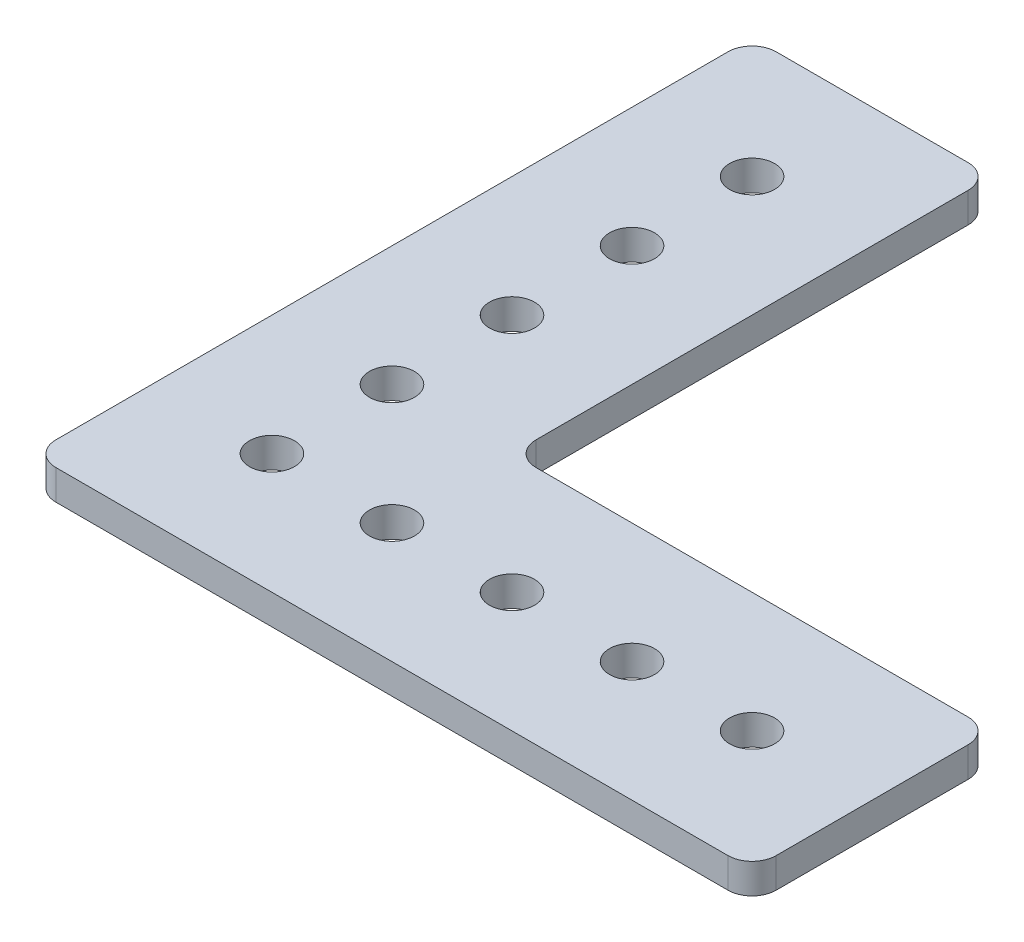
ISO-10303-21;
HEADER;
FILE_DESCRIPTION(('STEP AP214'),'2;1');
FILE_NAME('part.step','',(''),(''),'','','');
FILE_SCHEMA(('AUTOMOTIVE_DESIGN { 1 0 10303 214 1 1 1 1 }'));
ENDSEC;
DATA;
#1=APPLICATION_CONTEXT('core data for automotive mechanical design processes');
#2=APPLICATION_PROTOCOL_DEFINITION('international standard','automotive_design',2000,#1);
#3=PRODUCT_CONTEXT('',#1,'mechanical');
#4=PRODUCT('Part','Part','',(#3));
#5=PRODUCT_RELATED_PRODUCT_CATEGORY('part','',(#4));
#6=PRODUCT_DEFINITION_FORMATION('','',#4);
#7=PRODUCT_DEFINITION_CONTEXT('part definition',#1,'design');
#8=PRODUCT_DEFINITION('design','',#6,#7);
#9=PRODUCT_DEFINITION_SHAPE('','',#8);
#10=(LENGTH_UNIT() NAMED_UNIT(*) SI_UNIT(.MILLI.,.METRE.));
#11=(NAMED_UNIT(*) PLANE_ANGLE_UNIT() SI_UNIT($,.RADIAN.));
#12=(NAMED_UNIT(*) SI_UNIT($,.STERADIAN.) SOLID_ANGLE_UNIT());
#13=UNCERTAINTY_MEASURE_WITH_UNIT(LENGTH_MEASURE(1.E-05),#10,'distance_accuracy_value','');
#14=(GEOMETRIC_REPRESENTATION_CONTEXT(3) GLOBAL_UNCERTAINTY_ASSIGNED_CONTEXT((#13)) GLOBAL_UNIT_ASSIGNED_CONTEXT((#10,
#11,#12)) REPRESENTATION_CONTEXT('',''));
#15=CARTESIAN_POINT('',(0.,0.,0.));
#16=DIRECTION('',(0.,0.,1.));
#17=DIRECTION('',(1.,0.,0.));
#18=AXIS2_PLACEMENT_3D('',#15,#16,#17);
#19=CARTESIAN_POINT('',(2.54,3.175,-73.66));
#20=DIRECTION('',(0.,-1.,0.));
#21=DIRECTION('',(0.,0.,-1.));
#22=AXIS2_PLACEMENT_3D('',#19,#20,#21);
#23=CYLINDRICAL_SURFACE('',#22,2.54);
#24=CARTESIAN_POINT('',(2.54,0.,-73.66));
#25=DIRECTION('',(0.,1.,0.));
#26=DIRECTION('',(0.,0.,1.));
#27=AXIS2_PLACEMENT_3D('',#24,#25,#26);
#28=CIRCLE('',#27,2.54);
#29=CARTESIAN_POINT('',(0.,0.,-73.66));
#30=VERTEX_POINT('',#29);
#31=CARTESIAN_POINT('',(2.54,0.,-76.2));
#32=VERTEX_POINT('',#31);
#33=EDGE_CURVE('E193',#30,#32,#28,.F.);
#34=ORIENTED_EDGE('',*,*,#33,.F.);
#35=DIRECTION('',(0.,-1.,0.));
#36=VECTOR('',#35,1.);
#37=CARTESIAN_POINT('',(0.,3.175,-73.66));
#38=LINE('',#37,#36);
#39=CARTESIAN_POINT('',(0.,3.175,-73.66));
#40=VERTEX_POINT('',#39);
#41=EDGE_CURVE('E11',#40,#30,#38,.T.);
#42=ORIENTED_EDGE('',*,*,#41,.F.);
#43=CARTESIAN_POINT('',(2.54,3.175,-73.66));
#44=DIRECTION('',(0.,1.,0.));
#45=DIRECTION('',(0.,0.,1.));
#46=AXIS2_PLACEMENT_3D('',#43,#44,#45);
#47=CIRCLE('',#46,2.54);
#48=CARTESIAN_POINT('',(2.54,3.175,-76.2));
#49=VERTEX_POINT('',#48);
#50=EDGE_CURVE('E346',#40,#49,#47,.F.);
#51=ORIENTED_EDGE('',*,*,#50,.T.);
#52=DIRECTION('',(0.,-1.,0.));
#53=VECTOR('',#52,1.);
#54=CARTESIAN_POINT('',(2.54,3.175,-76.2));
#55=LINE('',#54,#53);
#56=EDGE_CURVE('E53',#49,#32,#55,.T.);
#57=ORIENTED_EDGE('',*,*,#56,.T.);
#58=EDGE_LOOP('',(#34,#42,#51,#57));
#59=FACE_BOUND('',#58,.T.);
#60=ADVANCED_FACE('F36',(#59),#23,.T.);
#61=CARTESIAN_POINT('',(0.,3.175,0.));
#62=DIRECTION('',(-1.,0.,0.));
#63=DIRECTION('',(0.,0.,1.));
#64=AXIS2_PLACEMENT_3D('',#61,#62,#63);
#65=PLANE('',#64);
#66=DIRECTION('',(0.,0.,-1.));
#67=VECTOR('',#66,1.);
#68=CARTESIAN_POINT('',(0.,0.,0.));
#69=LINE('',#68,#67);
#70=CARTESIAN_POINT('',(0.,0.,-2.54000000000002));
#71=VERTEX_POINT('',#70);
#72=EDGE_CURVE('E188',#71,#30,#69,.T.);
#73=ORIENTED_EDGE('',*,*,#72,.F.);
#74=DIRECTION('',(0.,-1.,0.));
#75=VECTOR('',#74,1.);
#76=CARTESIAN_POINT('',(0.,3.175,-2.54000000000002));
#77=LINE('',#76,#75);
#78=CARTESIAN_POINT('',(0.,3.175,-2.54000000000002));
#79=VERTEX_POINT('',#78);
#80=EDGE_CURVE('E45',#79,#71,#77,.T.);
#81=ORIENTED_EDGE('',*,*,#80,.F.);
#82=DIRECTION('',(0.,0.,-1.));
#83=VECTOR('',#82,1.);
#84=CARTESIAN_POINT('',(0.,3.175,0.));
#85=LINE('',#84,#83);
#86=EDGE_CURVE('E348',#79,#40,#85,.T.);
#87=ORIENTED_EDGE('',*,*,#86,.T.);
#88=ORIENTED_EDGE('',*,*,#41,.T.);
#89=EDGE_LOOP('',(#73,#81,#87,#88));
#90=FACE_BOUND('',#89,.T.);
#91=ADVANCED_FACE('F192',(#90),#65,.T.);
#92=CARTESIAN_POINT('',(2.54,3.175,-2.54));
#93=DIRECTION('',(0.,-1.,0.));
#94=DIRECTION('',(0.,0.,-1.));
#95=AXIS2_PLACEMENT_3D('',#92,#93,#94);
#96=CYLINDRICAL_SURFACE('',#95,2.54);
#97=CARTESIAN_POINT('',(2.54,0.,-2.54));
#98=DIRECTION('',(0.,1.,0.));
#99=DIRECTION('',(0.,0.,1.));
#100=AXIS2_PLACEMENT_3D('',#97,#98,#99);
#101=CIRCLE('',#100,2.54);
#102=CARTESIAN_POINT('',(2.54000000000002,0.,0.));
#103=VERTEX_POINT('',#102);
#104=EDGE_CURVE('E177',#71,#103,#101,.T.);
#105=ORIENTED_EDGE('',*,*,#104,.T.);
#106=DIRECTION('',(0.,-1.,0.));
#107=VECTOR('',#106,1.);
#108=CARTESIAN_POINT('',(2.54000000000002,3.175,0.));
#109=LINE('',#108,#107);
#110=CARTESIAN_POINT('',(2.54000000000002,3.175,0.));
#111=VERTEX_POINT('',#110);
#112=EDGE_CURVE('E169',#111,#103,#109,.T.);
#113=ORIENTED_EDGE('',*,*,#112,.F.);
#114=CARTESIAN_POINT('',(2.54,3.175,-2.54));
#115=DIRECTION('',(0.,1.,0.));
#116=DIRECTION('',(0.,0.,1.));
#117=AXIS2_PLACEMENT_3D('',#114,#115,#116);
#118=CIRCLE('',#117,2.54);
#119=EDGE_CURVE('E179',#79,#111,#118,.T.);
#120=ORIENTED_EDGE('',*,*,#119,.F.);
#121=ORIENTED_EDGE('',*,*,#80,.T.);
#122=EDGE_LOOP('',(#105,#113,#120,#121));
#123=FACE_BOUND('',#122,.T.);
#124=ADVANCED_FACE('F175',(#123),#96,.T.);
#125=CARTESIAN_POINT('',(0.,3.175,0.));
#126=DIRECTION('',(0.,0.,-1.));
#127=DIRECTION('',(-1.,0.,0.));
#128=AXIS2_PLACEMENT_3D('',#125,#126,#127);
#129=PLANE('',#128);
#130=DIRECTION('',(1.,0.,0.));
#131=VECTOR('',#130,1.);
#132=CARTESIAN_POINT('',(0.,0.,0.));
#133=LINE('',#132,#131);
#134=CARTESIAN_POINT('',(73.66,0.,0.));
#135=VERTEX_POINT('',#134);
#136=EDGE_CURVE('E190',#103,#135,#133,.T.);
#137=ORIENTED_EDGE('',*,*,#136,.T.);
#138=DIRECTION('',(0.,-1.,0.));
#139=VECTOR('',#138,1.);
#140=CARTESIAN_POINT('',(73.66,3.175,0.));
#141=LINE('',#140,#139);
#142=CARTESIAN_POINT('',(73.66,3.175,0.));
#143=VERTEX_POINT('',#142);
#144=EDGE_CURVE('E166',#143,#135,#141,.T.);
#145=ORIENTED_EDGE('',*,*,#144,.F.);
#146=DIRECTION('',(1.,0.,0.));
#147=VECTOR('',#146,1.);
#148=CARTESIAN_POINT('',(0.,3.175,0.));
#149=LINE('',#148,#147);
#150=EDGE_CURVE('E354',#111,#143,#149,.T.);
#151=ORIENTED_EDGE('',*,*,#150,.F.);
#152=ORIENTED_EDGE('',*,*,#112,.T.);
#153=EDGE_LOOP('',(#137,#145,#151,#152));
#154=FACE_BOUND('',#153,.T.);
#155=ADVANCED_FACE('F281',(#154),#129,.F.);
#156=CARTESIAN_POINT('',(73.66,3.175,-2.54));
#157=DIRECTION('',(0.,-1.,0.));
#158=DIRECTION('',(0.,0.,-1.));
#159=AXIS2_PLACEMENT_3D('',#156,#157,#158);
#160=CYLINDRICAL_SURFACE('',#159,2.54);
#161=CARTESIAN_POINT('',(73.66,0.,-2.54));
#162=DIRECTION('',(0.,1.,0.));
#163=DIRECTION('',(0.,0.,1.));
#164=AXIS2_PLACEMENT_3D('',#161,#162,#163);
#165=CIRCLE('',#164,2.54);
#166=CARTESIAN_POINT('',(76.2,0.,-2.54));
#167=VERTEX_POINT('',#166);
#168=EDGE_CURVE('E200',#135,#167,#165,.T.);
#169=ORIENTED_EDGE('',*,*,#168,.T.);
#170=DIRECTION('',(0.,-1.,0.));
#171=VECTOR('',#170,1.);
#172=CARTESIAN_POINT('',(76.2,3.175,-2.54));
#173=LINE('',#172,#171);
#174=CARTESIAN_POINT('',(76.2,3.175,-2.54));
#175=VERTEX_POINT('',#174);
#176=EDGE_CURVE('E163',#175,#167,#173,.T.);
#177=ORIENTED_EDGE('',*,*,#176,.F.);
#178=CARTESIAN_POINT('',(73.66,3.175,-2.54));
#179=DIRECTION('',(0.,1.,0.));
#180=DIRECTION('',(0.,0.,1.));
#181=AXIS2_PLACEMENT_3D('',#178,#179,#180);
#182=CIRCLE('',#181,2.54);
#183=EDGE_CURVE('E357',#143,#175,#182,.T.);
#184=ORIENTED_EDGE('',*,*,#183,.F.);
#185=ORIENTED_EDGE('',*,*,#144,.T.);
#186=EDGE_LOOP('',(#169,#177,#184,#185));
#187=FACE_BOUND('',#186,.T.);
#188=ADVANCED_FACE('F284',(#187),#160,.T.);
#189=CARTESIAN_POINT('',(76.2,3.175,0.));
#190=DIRECTION('',(-1.,0.,0.));
#191=DIRECTION('',(0.,0.,1.));
#192=AXIS2_PLACEMENT_3D('',#189,#190,#191);
#193=PLANE('',#192);
#194=DIRECTION('',(0.,0.,-1.));
#195=VECTOR('',#194,1.);
#196=CARTESIAN_POINT('',(76.2,0.,0.));
#197=LINE('',#196,#195);
#198=CARTESIAN_POINT('',(76.2,0.,-22.86));
#199=VERTEX_POINT('',#198);
#200=EDGE_CURVE('E203',#167,#199,#197,.T.);
#201=ORIENTED_EDGE('',*,*,#200,.T.);
#202=DIRECTION('',(0.,-1.,0.));
#203=VECTOR('',#202,1.);
#204=CARTESIAN_POINT('',(76.2,3.175,-22.86));
#205=LINE('',#204,#203);
#206=CARTESIAN_POINT('',(76.2,3.175,-22.86));
#207=VERTEX_POINT('',#206);
#208=EDGE_CURVE('E160',#207,#199,#205,.T.);
#209=ORIENTED_EDGE('',*,*,#208,.F.);
#210=DIRECTION('',(0.,0.,-1.));
#211=VECTOR('',#210,1.);
#212=CARTESIAN_POINT('',(76.2,3.175,0.));
#213=LINE('',#212,#211);
#214=EDGE_CURVE('E360',#175,#207,#213,.T.);
#215=ORIENTED_EDGE('',*,*,#214,.F.);
#216=ORIENTED_EDGE('',*,*,#176,.T.);
#217=EDGE_LOOP('',(#201,#209,#215,#216));
#218=FACE_BOUND('',#217,.T.);
#219=ADVANCED_FACE('F288',(#218),#193,.F.);
#220=CARTESIAN_POINT('',(73.66,3.175,-22.86));
#221=DIRECTION('',(0.,-1.,0.));
#222=DIRECTION('',(0.,0.,-1.));
#223=AXIS2_PLACEMENT_3D('',#220,#221,#222);
#224=CYLINDRICAL_SURFACE('',#223,2.54);
#225=CARTESIAN_POINT('',(73.66,0.,-22.86));
#226=DIRECTION('',(0.,1.,0.));
#227=DIRECTION('',(0.,0.,1.));
#228=AXIS2_PLACEMENT_3D('',#225,#226,#227);
#229=CIRCLE('',#228,2.54);
#230=CARTESIAN_POINT('',(73.66,0.,-25.4));
#231=VERTEX_POINT('',#230);
#232=EDGE_CURVE('E206',#199,#231,#229,.T.);
#233=ORIENTED_EDGE('',*,*,#232,.T.);
#234=DIRECTION('',(0.,-1.,0.));
#235=VECTOR('',#234,1.);
#236=CARTESIAN_POINT('',(73.66,3.175,-25.4));
#237=LINE('',#236,#235);
#238=CARTESIAN_POINT('',(73.66,3.175,-25.4));
#239=VERTEX_POINT('',#238);
#240=EDGE_CURVE('E158',#239,#231,#237,.T.);
#241=ORIENTED_EDGE('',*,*,#240,.F.);
#242=CARTESIAN_POINT('',(73.66,3.175,-22.86));
#243=DIRECTION('',(0.,1.,0.));
#244=DIRECTION('',(0.,0.,1.));
#245=AXIS2_PLACEMENT_3D('',#242,#243,#244);
#246=CIRCLE('',#245,2.54);
#247=EDGE_CURVE('E363',#207,#239,#246,.T.);
#248=ORIENTED_EDGE('',*,*,#247,.F.);
#249=ORIENTED_EDGE('',*,*,#208,.T.);
#250=EDGE_LOOP('',(#233,#241,#248,#249));
#251=FACE_BOUND('',#250,.T.);
#252=ADVANCED_FACE('F292',(#251),#224,.T.);
#253=CARTESIAN_POINT('',(0.,3.175,-25.4));
#254=DIRECTION('',(0.,0.,-1.));
#255=DIRECTION('',(-1.,0.,0.));
#256=AXIS2_PLACEMENT_3D('',#253,#254,#255);
#257=PLANE('',#256);
#258=DIRECTION('',(1.,0.,0.));
#259=VECTOR('',#258,1.);
#260=CARTESIAN_POINT('',(0.,0.,-25.4));
#261=LINE('',#260,#259);
#262=CARTESIAN_POINT('',(27.94,0.,-25.4));
#263=VERTEX_POINT('',#262);
#264=EDGE_CURVE('E209',#263,#231,#261,.T.);
#265=ORIENTED_EDGE('',*,*,#264,.F.);
#266=DIRECTION('',(0.,-1.,0.));
#267=VECTOR('',#266,1.);
#268=CARTESIAN_POINT('',(27.94,3.175,-25.4));
#269=LINE('',#268,#267);
#270=CARTESIAN_POINT('',(27.94,3.175,-25.4));
#271=VERTEX_POINT('',#270);
#272=EDGE_CURVE('E152',#271,#263,#269,.T.);
#273=ORIENTED_EDGE('',*,*,#272,.F.);
#274=DIRECTION('',(1.,0.,0.));
#275=VECTOR('',#274,1.);
#276=CARTESIAN_POINT('',(0.,3.175,-25.4));
#277=LINE('',#276,#275);
#278=EDGE_CURVE('E365',#271,#239,#277,.T.);
#279=ORIENTED_EDGE('',*,*,#278,.T.);
#280=ORIENTED_EDGE('',*,*,#240,.T.);
#281=EDGE_LOOP('',(#265,#273,#279,#280));
#282=FACE_BOUND('',#281,.T.);
#283=ADVANCED_FACE('F296',(#282),#257,.T.);
#284=CARTESIAN_POINT('',(27.94,3.175,-27.94));
#285=DIRECTION('',(0.,-1.,0.));
#286=DIRECTION('',(0.,0.,-1.));
#287=AXIS2_PLACEMENT_3D('',#284,#285,#286);
#288=CYLINDRICAL_SURFACE('',#287,2.54);
#289=CARTESIAN_POINT('',(27.94,0.,-27.94));
#290=DIRECTION('',(0.,1.,0.));
#291=DIRECTION('',(0.,0.,1.));
#292=AXIS2_PLACEMENT_3D('',#289,#290,#291);
#293=CIRCLE('',#292,2.54);
#294=CARTESIAN_POINT('',(25.4,0.,-27.94));
#295=VERTEX_POINT('',#294);
#296=EDGE_CURVE('E212',#263,#295,#293,.F.);
#297=ORIENTED_EDGE('',*,*,#296,.T.);
#298=DIRECTION('',(0.,-1.,0.));
#299=VECTOR('',#298,1.);
#300=CARTESIAN_POINT('',(25.4,3.175,-27.94));
#301=LINE('',#300,#299);
#302=CARTESIAN_POINT('',(25.4,3.175,-27.94));
#303=VERTEX_POINT('',#302);
#304=EDGE_CURVE('E150',#303,#295,#301,.T.);
#305=ORIENTED_EDGE('',*,*,#304,.F.);
#306=CARTESIAN_POINT('',(27.94,3.175,-27.94));
#307=DIRECTION('',(0.,1.,0.));
#308=DIRECTION('',(0.,0.,1.));
#309=AXIS2_PLACEMENT_3D('',#306,#307,#308);
#310=CIRCLE('',#309,2.54);
#311=EDGE_CURVE('E143',#271,#303,#310,.F.);
#312=ORIENTED_EDGE('',*,*,#311,.F.);
#313=ORIENTED_EDGE('',*,*,#272,.T.);
#314=EDGE_LOOP('',(#297,#305,#312,#313));
#315=FACE_BOUND('',#314,.T.);
#316=ADVANCED_FACE('F300',(#315),#288,.F.);
#317=CARTESIAN_POINT('',(25.4,3.175,0.));
#318=DIRECTION('',(-1.,0.,0.));
#319=DIRECTION('',(0.,0.,1.));
#320=AXIS2_PLACEMENT_3D('',#317,#318,#319);
#321=PLANE('',#320);
#322=DIRECTION('',(0.,0.,-1.));
#323=VECTOR('',#322,1.);
#324=CARTESIAN_POINT('',(25.4,0.,0.));
#325=LINE('',#324,#323);
#326=CARTESIAN_POINT('',(25.4,0.,-73.66));
#327=VERTEX_POINT('',#326);
#328=EDGE_CURVE('E149',#295,#327,#325,.T.);
#329=ORIENTED_EDGE('',*,*,#328,.T.);
#330=DIRECTION('',(0.,-1.,0.));
#331=VECTOR('',#330,1.);
#332=CARTESIAN_POINT('',(25.4,3.175,-73.66));
#333=LINE('',#332,#331);
#334=CARTESIAN_POINT('',(25.4,3.175,-73.66));
#335=VERTEX_POINT('',#334);
#336=EDGE_CURVE('E131',#335,#327,#333,.T.);
#337=ORIENTED_EDGE('',*,*,#336,.F.);
#338=DIRECTION('',(0.,0.,-1.));
#339=VECTOR('',#338,1.);
#340=CARTESIAN_POINT('',(25.4,3.175,0.));
#341=LINE('',#340,#339);
#342=EDGE_CURVE('E136',#303,#335,#341,.T.);
#343=ORIENTED_EDGE('',*,*,#342,.F.);
#344=ORIENTED_EDGE('',*,*,#304,.T.);
#345=EDGE_LOOP('',(#329,#337,#343,#344));
#346=FACE_BOUND('',#345,.T.);
#347=ADVANCED_FACE('F148',(#346),#321,.F.);
#348=CARTESIAN_POINT('',(22.86,3.175,-73.66));
#349=DIRECTION('',(0.,-1.,0.));
#350=DIRECTION('',(0.,0.,-1.));
#351=AXIS2_PLACEMENT_3D('',#348,#349,#350);
#352=CYLINDRICAL_SURFACE('',#351,2.54);
#353=CARTESIAN_POINT('',(22.86,0.,-73.66));
#354=DIRECTION('',(0.,1.,0.));
#355=DIRECTION('',(0.,0.,1.));
#356=AXIS2_PLACEMENT_3D('',#353,#354,#355);
#357=CIRCLE('',#356,2.54);
#358=CARTESIAN_POINT('',(22.86,0.,-76.2));
#359=VERTEX_POINT('',#358);
#360=EDGE_CURVE('E216',#327,#359,#357,.T.);
#361=ORIENTED_EDGE('',*,*,#360,.T.);
#362=DIRECTION('',(0.,-1.,0.));
#363=VECTOR('',#362,1.);
#364=CARTESIAN_POINT('',(22.86,3.175,-76.2));
#365=LINE('',#364,#363);
#366=CARTESIAN_POINT('',(22.86,3.175,-76.2));
#367=VERTEX_POINT('',#366);
#368=EDGE_CURVE('E91',#367,#359,#365,.T.);
#369=ORIENTED_EDGE('',*,*,#368,.F.);
#370=CARTESIAN_POINT('',(22.86,3.175,-73.66));
#371=DIRECTION('',(0.,1.,0.));
#372=DIRECTION('',(0.,0.,1.));
#373=AXIS2_PLACEMENT_3D('',#370,#371,#372);
#374=CIRCLE('',#373,2.54);
#375=EDGE_CURVE('E127',#335,#367,#374,.T.);
#376=ORIENTED_EDGE('',*,*,#375,.F.);
#377=ORIENTED_EDGE('',*,*,#336,.T.);
#378=EDGE_LOOP('',(#361,#369,#376,#377));
#379=FACE_BOUND('',#378,.T.);
#380=ADVANCED_FACE('F129',(#379),#352,.T.);
#381=CARTESIAN_POINT('',(25.4,3.175,-12.7));
#382=DIRECTION('',(0.,-1.,0.));
#383=DIRECTION('',(0.,0.,-1.));
#384=AXIS2_PLACEMENT_3D('',#381,#382,#383);
#385=CYLINDRICAL_SURFACE('',#384,2.38125);
#386=CARTESIAN_POINT('',(25.4,3.175,-12.7));
#387=DIRECTION('',(0.,1.,0.));
#388=DIRECTION('',(0.,0.,1.));
#389=AXIS2_PLACEMENT_3D('',#386,#387,#388);
#390=CIRCLE('',#389,2.38125);
#391=CARTESIAN_POINT('',(25.4,3.175,-10.31875));
#392=VERTEX_POINT('',#391);
#393=EDGE_CURVE('E244',#392,#392,#390,.T.);
#394=ORIENTED_EDGE('',*,*,#393,.T.);
#395=EDGE_LOOP('',(#394));
#396=FACE_BOUND('',#395,.T.);
#397=CARTESIAN_POINT('',(25.4,0.,-12.7));
#398=DIRECTION('',(0.,1.,0.));
#399=DIRECTION('',(0.,0.,1.));
#400=AXIS2_PLACEMENT_3D('',#397,#398,#399);
#401=CIRCLE('',#400,2.38125);
#402=CARTESIAN_POINT('',(25.4,0.,-10.31875));
#403=VERTEX_POINT('',#402);
#404=EDGE_CURVE('E236',#403,#403,#401,.T.);
#405=ORIENTED_EDGE('',*,*,#404,.F.);
#406=EDGE_LOOP('',(#405));
#407=FACE_BOUND('',#406,.T.);
#408=ADVANCED_FACE('F308',(#396,#407),#385,.F.);
#409=CARTESIAN_POINT('',(38.1,3.175,-12.7));
#410=DIRECTION('',(0.,-1.,0.));
#411=DIRECTION('',(0.,0.,-1.));
#412=AXIS2_PLACEMENT_3D('',#409,#410,#411);
#413=CYLINDRICAL_SURFACE('',#412,2.38125);
#414=CARTESIAN_POINT('',(38.1,3.175,-12.7));
#415=DIRECTION('',(0.,1.,0.));
#416=DIRECTION('',(0.,0.,1.));
#417=AXIS2_PLACEMENT_3D('',#414,#415,#416);
#418=CIRCLE('',#417,2.38125);
#419=CARTESIAN_POINT('',(38.1,3.175,-10.31875));
#420=VERTEX_POINT('',#419);
#421=EDGE_CURVE('E249',#420,#420,#418,.T.);
#422=ORIENTED_EDGE('',*,*,#421,.T.);
#423=EDGE_LOOP('',(#422));
#424=FACE_BOUND('',#423,.T.);
#425=CARTESIAN_POINT('',(38.1,0.,-12.7));
#426=DIRECTION('',(0.,1.,0.));
#427=DIRECTION('',(0.,0.,1.));
#428=AXIS2_PLACEMENT_3D('',#425,#426,#427);
#429=CIRCLE('',#428,2.38125);
#430=CARTESIAN_POINT('',(38.1,0.,-10.31875));
#431=VERTEX_POINT('',#430);
#432=EDGE_CURVE('E233',#431,#431,#429,.T.);
#433=ORIENTED_EDGE('',*,*,#432,.F.);
#434=EDGE_LOOP('',(#433));
#435=FACE_BOUND('',#434,.T.);
#436=ADVANCED_FACE('F324',(#424,#435),#413,.F.);
#437=CARTESIAN_POINT('',(50.8,3.175,-12.7));
#438=DIRECTION('',(0.,-1.,0.));
#439=DIRECTION('',(0.,0.,-1.));
#440=AXIS2_PLACEMENT_3D('',#437,#438,#439);
#441=CYLINDRICAL_SURFACE('',#440,2.38125);
#442=CARTESIAN_POINT('',(50.8,3.175,-12.7));
#443=DIRECTION('',(0.,1.,0.));
#444=DIRECTION('',(0.,0.,1.));
#445=AXIS2_PLACEMENT_3D('',#442,#443,#444);
#446=CIRCLE('',#445,2.38125);
#447=CARTESIAN_POINT('',(50.8,3.175,-10.31875));
#448=VERTEX_POINT('',#447);
#449=EDGE_CURVE('E379',#448,#448,#446,.T.);
#450=ORIENTED_EDGE('',*,*,#449,.T.);
#451=EDGE_LOOP('',(#450));
#452=FACE_BOUND('',#451,.T.);
#453=CARTESIAN_POINT('',(50.8,0.,-12.7));
#454=DIRECTION('',(0.,1.,0.));
#455=DIRECTION('',(0.,0.,1.));
#456=AXIS2_PLACEMENT_3D('',#453,#454,#455);
#457=CIRCLE('',#456,2.38125);
#458=CARTESIAN_POINT('',(50.8,0.,-10.31875));
#459=VERTEX_POINT('',#458);
#460=EDGE_CURVE('E230',#459,#459,#457,.T.);
#461=ORIENTED_EDGE('',*,*,#460,.F.);
#462=EDGE_LOOP('',(#461));
#463=FACE_BOUND('',#462,.T.);
#464=ADVANCED_FACE('F320',(#452,#463),#441,.F.);
#465=CARTESIAN_POINT('',(12.7,3.175,-25.4));
#466=DIRECTION('',(0.,-1.,0.));
#467=DIRECTION('',(0.,0.,-1.));
#468=AXIS2_PLACEMENT_3D('',#465,#466,#467);
#469=CYLINDRICAL_SURFACE('',#468,2.38125);
#470=CARTESIAN_POINT('',(12.7,3.175,-25.4));
#471=DIRECTION('',(0.,1.,0.));
#472=DIRECTION('',(0.,0.,1.));
#473=AXIS2_PLACEMENT_3D('',#470,#471,#472);
#474=CIRCLE('',#473,2.38125);
#475=CARTESIAN_POINT('',(12.7,3.175,-23.01875));
#476=VERTEX_POINT('',#475);
#477=EDGE_CURVE('E376',#476,#476,#474,.T.);
#478=ORIENTED_EDGE('',*,*,#477,.T.);
#479=EDGE_LOOP('',(#478));
#480=FACE_BOUND('',#479,.T.);
#481=CARTESIAN_POINT('',(12.7,0.,-25.4));
#482=DIRECTION('',(0.,1.,0.));
#483=DIRECTION('',(0.,0.,1.));
#484=AXIS2_PLACEMENT_3D('',#481,#482,#483);
#485=CIRCLE('',#484,2.38125);
#486=CARTESIAN_POINT('',(12.7,0.,-23.01875));
#487=VERTEX_POINT('',#486);
#488=EDGE_CURVE('E227',#487,#487,#485,.T.);
#489=ORIENTED_EDGE('',*,*,#488,.F.);
#490=EDGE_LOOP('',(#489));
#491=FACE_BOUND('',#490,.T.);
#492=ADVANCED_FACE('F316',(#480,#491),#469,.F.);
#493=CARTESIAN_POINT('',(12.7,3.175,-38.1));
#494=DIRECTION('',(0.,-1.,0.));
#495=DIRECTION('',(0.,0.,-1.));
#496=AXIS2_PLACEMENT_3D('',#493,#494,#495);
#497=CYLINDRICAL_SURFACE('',#496,2.38125);
#498=CARTESIAN_POINT('',(12.7,3.175,-38.1));
#499=DIRECTION('',(0.,1.,0.));
#500=DIRECTION('',(0.,0.,1.));
#501=AXIS2_PLACEMENT_3D('',#498,#499,#500);
#502=CIRCLE('',#501,2.38125);
#503=CARTESIAN_POINT('',(12.7,3.175,-35.71875));
#504=VERTEX_POINT('',#503);
#505=EDGE_CURVE('E373',#504,#504,#502,.T.);
#506=ORIENTED_EDGE('',*,*,#505,.T.);
#507=EDGE_LOOP('',(#506));
#508=FACE_BOUND('',#507,.T.);
#509=CARTESIAN_POINT('',(12.7,0.,-38.1));
#510=DIRECTION('',(0.,1.,0.));
#511=DIRECTION('',(0.,0.,1.));
#512=AXIS2_PLACEMENT_3D('',#509,#510,#511);
#513=CIRCLE('',#512,2.38125);
#514=CARTESIAN_POINT('',(12.7,0.,-35.71875));
#515=VERTEX_POINT('',#514);
#516=EDGE_CURVE('E224',#515,#515,#513,.T.);
#517=ORIENTED_EDGE('',*,*,#516,.F.);
#518=EDGE_LOOP('',(#517));
#519=FACE_BOUND('',#518,.T.);
#520=ADVANCED_FACE('F312',(#508,#519),#497,.F.);
#521=CARTESIAN_POINT('',(12.7,3.175,-50.8));
#522=DIRECTION('',(0.,-1.,0.));
#523=DIRECTION('',(0.,0.,-1.));
#524=AXIS2_PLACEMENT_3D('',#521,#522,#523);
#525=CYLINDRICAL_SURFACE('',#524,2.38125);
#526=CARTESIAN_POINT('',(12.7,3.175,-50.8));
#527=DIRECTION('',(0.,1.,0.));
#528=DIRECTION('',(0.,0.,1.));
#529=AXIS2_PLACEMENT_3D('',#526,#527,#528);
#530=CIRCLE('',#529,2.38125);
#531=CARTESIAN_POINT('',(12.7,3.175,-48.41875));
#532=VERTEX_POINT('',#531);
#533=EDGE_CURVE('E370',#532,#532,#530,.T.);
#534=ORIENTED_EDGE('',*,*,#533,.T.);
#535=EDGE_LOOP('',(#534));
#536=FACE_BOUND('',#535,.T.);
#537=CARTESIAN_POINT('',(12.7,0.,-50.8));
#538=DIRECTION('',(0.,1.,0.));
#539=DIRECTION('',(0.,0.,1.));
#540=AXIS2_PLACEMENT_3D('',#537,#538,#539);
#541=CIRCLE('',#540,2.38125);
#542=CARTESIAN_POINT('',(12.7,0.,-48.41875));
#543=VERTEX_POINT('',#542);
#544=EDGE_CURVE('E221',#543,#543,#541,.T.);
#545=ORIENTED_EDGE('',*,*,#544,.F.);
#546=EDGE_LOOP('',(#545));
#547=FACE_BOUND('',#546,.T.);
#548=ADVANCED_FACE('F269',(#536,#547),#525,.F.);
#549=CARTESIAN_POINT('',(0.,3.175,-76.2));
#550=DIRECTION('',(0.,0.,-1.));
#551=DIRECTION('',(-1.,0.,0.));
#552=AXIS2_PLACEMENT_3D('',#549,#550,#551);
#553=PLANE('',#552);
#554=DIRECTION('',(1.,0.,0.));
#555=VECTOR('',#554,1.);
#556=CARTESIAN_POINT('',(0.,0.,-76.2));
#557=LINE('',#556,#555);
#558=EDGE_CURVE('E218',#32,#359,#557,.T.);
#559=ORIENTED_EDGE('',*,*,#558,.F.);
#560=ORIENTED_EDGE('',*,*,#56,.F.);
#561=DIRECTION('',(1.,0.,0.));
#562=VECTOR('',#561,1.);
#563=CARTESIAN_POINT('',(0.,3.175,-76.2));
#564=LINE('',#563,#562);
#565=EDGE_CURVE('E135',#49,#367,#564,.T.);
#566=ORIENTED_EDGE('',*,*,#565,.T.);
#567=ORIENTED_EDGE('',*,*,#368,.T.);
#568=EDGE_LOOP('',(#559,#560,#566,#567));
#569=FACE_BOUND('',#568,.T.);
#570=ADVANCED_FACE('F261',(#569),#553,.T.);
#571=CARTESIAN_POINT('',(12.7,3.175,-63.5));
#572=DIRECTION('',(0.,-1.,0.));
#573=DIRECTION('',(0.,0.,-1.));
#574=AXIS2_PLACEMENT_3D('',#571,#572,#573);
#575=CYLINDRICAL_SURFACE('',#574,2.38125);
#576=CARTESIAN_POINT('',(12.7,3.175,-63.5));
#577=DIRECTION('',(0.,1.,0.));
#578=DIRECTION('',(0.,0.,1.));
#579=AXIS2_PLACEMENT_3D('',#576,#577,#578);
#580=CIRCLE('',#579,2.38125);
#581=CARTESIAN_POINT('',(12.7,3.175,-61.11875));
#582=VERTEX_POINT('',#581);
#583=EDGE_CURVE('E345',#582,#582,#580,.T.);
#584=ORIENTED_EDGE('',*,*,#583,.T.);
#585=EDGE_LOOP('',(#584));
#586=FACE_BOUND('',#585,.T.);
#587=CARTESIAN_POINT('',(12.7,0.,-63.5));
#588=DIRECTION('',(0.,1.,0.));
#589=DIRECTION('',(0.,0.,1.));
#590=AXIS2_PLACEMENT_3D('',#587,#588,#589);
#591=CIRCLE('',#590,2.38125);
#592=CARTESIAN_POINT('',(12.7,0.,-61.11875));
#593=VERTEX_POINT('',#592);
#594=EDGE_CURVE('E195',#593,#593,#591,.T.);
#595=ORIENTED_EDGE('',*,*,#594,.F.);
#596=EDGE_LOOP('',(#595));
#597=FACE_BOUND('',#596,.T.);
#598=ADVANCED_FACE('F259',(#586,#597),#575,.F.);
#599=CARTESIAN_POINT('',(63.5,3.175,-12.7));
#600=DIRECTION('',(0.,-1.,0.));
#601=DIRECTION('',(0.,0.,-1.));
#602=AXIS2_PLACEMENT_3D('',#599,#600,#601);
#603=CYLINDRICAL_SURFACE('',#602,2.38125000000001);
#604=CARTESIAN_POINT('',(63.5,3.175,-12.7));
#605=DIRECTION('',(0.,1.,0.));
#606=DIRECTION('',(0.,0.,1.));
#607=AXIS2_PLACEMENT_3D('',#604,#605,#606);
#608=CIRCLE('',#607,2.38125000000001);
#609=CARTESIAN_POINT('',(63.5,3.175,-10.31875));
#610=VERTEX_POINT('',#609);
#611=EDGE_CURVE('E241',#610,#610,#608,.T.);
#612=ORIENTED_EDGE('',*,*,#611,.T.);
#613=EDGE_LOOP('',(#612));
#614=FACE_BOUND('',#613,.T.);
#615=CARTESIAN_POINT('',(63.5,0.,-12.7));
#616=DIRECTION('',(0.,1.,0.));
#617=DIRECTION('',(0.,0.,1.));
#618=AXIS2_PLACEMENT_3D('',#615,#616,#617);
#619=CIRCLE('',#618,2.38125000000001);
#620=CARTESIAN_POINT('',(63.5,0.,-10.31875));
#621=VERTEX_POINT('',#620);
#622=EDGE_CURVE('E253',#621,#621,#619,.T.);
#623=ORIENTED_EDGE('',*,*,#622,.F.);
#624=EDGE_LOOP('',(#623));
#625=FACE_BOUND('',#624,.T.);
#626=ADVANCED_FACE('F38',(#614,#625),#603,.F.);
#627=CARTESIAN_POINT('',(12.7,3.175,-12.7));
#628=DIRECTION('',(0.,-1.,0.));
#629=DIRECTION('',(0.,0.,-1.));
#630=AXIS2_PLACEMENT_3D('',#627,#628,#629);
#631=CYLINDRICAL_SURFACE('',#630,2.38125);
#632=CARTESIAN_POINT('',(12.7,3.175,-12.7));
#633=DIRECTION('',(0.,1.,0.));
#634=DIRECTION('',(0.,0.,1.));
#635=AXIS2_PLACEMENT_3D('',#632,#633,#634);
#636=CIRCLE('',#635,2.38125);
#637=CARTESIAN_POINT('',(12.7,3.175,-10.31875));
#638=VERTEX_POINT('',#637);
#639=EDGE_CURVE('E242',#638,#638,#636,.T.);
#640=ORIENTED_EDGE('',*,*,#639,.T.);
#641=EDGE_LOOP('',(#640));
#642=FACE_BOUND('',#641,.T.);
#643=CARTESIAN_POINT('',(12.7,0.,-12.7));
#644=DIRECTION('',(0.,1.,0.));
#645=DIRECTION('',(0.,0.,1.));
#646=AXIS2_PLACEMENT_3D('',#643,#644,#645);
#647=CIRCLE('',#646,2.38125);
#648=CARTESIAN_POINT('',(12.7,0.,-10.31875));
#649=VERTEX_POINT('',#648);
#650=EDGE_CURVE('E239',#649,#649,#647,.T.);
#651=ORIENTED_EDGE('',*,*,#650,.F.);
#652=EDGE_LOOP('',(#651));
#653=FACE_BOUND('',#652,.T.);
#654=ADVANCED_FACE('F267',(#642,#653),#631,.F.);
#655=CARTESIAN_POINT('',(0.,3.175,0.));
#656=DIRECTION('',(0.,1.,0.));
#657=DIRECTION('',(0.,0.,1.));
#658=AXIS2_PLACEMENT_3D('',#655,#656,#657);
#659=PLANE('',#658);
#660=ORIENTED_EDGE('',*,*,#611,.F.);
#661=EDGE_LOOP('',(#660));
#662=FACE_BOUND('',#661,.T.);
#663=ORIENTED_EDGE('',*,*,#583,.F.);
#664=EDGE_LOOP('',(#663));
#665=FACE_BOUND('',#664,.T.);
#666=ORIENTED_EDGE('',*,*,#50,.F.);
#667=ORIENTED_EDGE('',*,*,#86,.F.);
#668=ORIENTED_EDGE('',*,*,#119,.T.);
#669=ORIENTED_EDGE('',*,*,#150,.T.);
#670=ORIENTED_EDGE('',*,*,#183,.T.);
#671=ORIENTED_EDGE('',*,*,#214,.T.);
#672=ORIENTED_EDGE('',*,*,#247,.T.);
#673=ORIENTED_EDGE('',*,*,#278,.F.);
#674=ORIENTED_EDGE('',*,*,#311,.T.);
#675=ORIENTED_EDGE('',*,*,#342,.T.);
#676=ORIENTED_EDGE('',*,*,#375,.T.);
#677=ORIENTED_EDGE('',*,*,#565,.F.);
#678=EDGE_LOOP('',(#666,#667,#668,#669,#670,#671,#672,#673,#674,#675,#676,#677));
#679=FACE_BOUND('',#678,.T.);
#680=ORIENTED_EDGE('',*,*,#533,.F.);
#681=EDGE_LOOP('',(#680));
#682=FACE_BOUND('',#681,.T.);
#683=ORIENTED_EDGE('',*,*,#505,.F.);
#684=EDGE_LOOP('',(#683));
#685=FACE_BOUND('',#684,.T.);
#686=ORIENTED_EDGE('',*,*,#477,.F.);
#687=EDGE_LOOP('',(#686));
#688=FACE_BOUND('',#687,.T.);
#689=ORIENTED_EDGE('',*,*,#449,.F.);
#690=EDGE_LOOP('',(#689));
#691=FACE_BOUND('',#690,.T.);
#692=ORIENTED_EDGE('',*,*,#421,.F.);
#693=EDGE_LOOP('',(#692));
#694=FACE_BOUND('',#693,.T.);
#695=ORIENTED_EDGE('',*,*,#393,.F.);
#696=EDGE_LOOP('',(#695));
#697=FACE_BOUND('',#696,.T.);
#698=ORIENTED_EDGE('',*,*,#639,.F.);
#699=EDGE_LOOP('',(#698));
#700=FACE_BOUND('',#699,.T.);
#701=ADVANCED_FACE('F139',(#662,#665,#679,#682,#685,#688,#691,#694,#697,#700),#659,.T.);
#702=CARTESIAN_POINT('',(0.,0.,0.));
#703=DIRECTION('',(0.,1.,0.));
#704=DIRECTION('',(0.,0.,1.));
#705=AXIS2_PLACEMENT_3D('',#702,#703,#704);
#706=PLANE('',#705);
#707=ORIENTED_EDGE('',*,*,#622,.T.);
#708=EDGE_LOOP('',(#707));
#709=FACE_BOUND('',#708,.T.);
#710=ORIENTED_EDGE('',*,*,#594,.T.);
#711=EDGE_LOOP('',(#710));
#712=FACE_BOUND('',#711,.T.);
#713=ORIENTED_EDGE('',*,*,#33,.T.);
#714=ORIENTED_EDGE('',*,*,#558,.T.);
#715=ORIENTED_EDGE('',*,*,#360,.F.);
#716=ORIENTED_EDGE('',*,*,#328,.F.);
#717=ORIENTED_EDGE('',*,*,#296,.F.);
#718=ORIENTED_EDGE('',*,*,#264,.T.);
#719=ORIENTED_EDGE('',*,*,#232,.F.);
#720=ORIENTED_EDGE('',*,*,#200,.F.);
#721=ORIENTED_EDGE('',*,*,#168,.F.);
#722=ORIENTED_EDGE('',*,*,#136,.F.);
#723=ORIENTED_EDGE('',*,*,#104,.F.);
#724=ORIENTED_EDGE('',*,*,#72,.T.);
#725=EDGE_LOOP('',(#713,#714,#715,#716,#717,#718,#719,#720,#721,#722,#723,#724));
#726=FACE_BOUND('',#725,.T.);
#727=ORIENTED_EDGE('',*,*,#544,.T.);
#728=EDGE_LOOP('',(#727));
#729=FACE_BOUND('',#728,.T.);
#730=ORIENTED_EDGE('',*,*,#516,.T.);
#731=EDGE_LOOP('',(#730));
#732=FACE_BOUND('',#731,.T.);
#733=ORIENTED_EDGE('',*,*,#488,.T.);
#734=EDGE_LOOP('',(#733));
#735=FACE_BOUND('',#734,.T.);
#736=ORIENTED_EDGE('',*,*,#460,.T.);
#737=EDGE_LOOP('',(#736));
#738=FACE_BOUND('',#737,.T.);
#739=ORIENTED_EDGE('',*,*,#432,.T.);
#740=EDGE_LOOP('',(#739));
#741=FACE_BOUND('',#740,.T.);
#742=ORIENTED_EDGE('',*,*,#404,.T.);
#743=EDGE_LOOP('',(#742));
#744=FACE_BOUND('',#743,.T.);
#745=ORIENTED_EDGE('',*,*,#650,.T.);
#746=EDGE_LOOP('',(#745));
#747=FACE_BOUND('',#746,.T.);
#748=ADVANCED_FACE('F186',(#709,#712,#726,#729,#732,#735,#738,#741,#744,#747),#706,.F.);
#749=CLOSED_SHELL('',(#60,#91,#124,#155,#188,#219,#252,#283,#316,#347,#380,#408,#436,#464,#492,
#520,#548,#570,#598,#626,#654,#701,#748));
#750=MANIFOLD_SOLID_BREP('B2',#749);
#751=ADVANCED_BREP_SHAPE_REPRESENTATION('',(#18,#750),#14);
#752=SHAPE_DEFINITION_REPRESENTATION(#9,#751);
ENDSEC;
END-ISO-10303-21;
